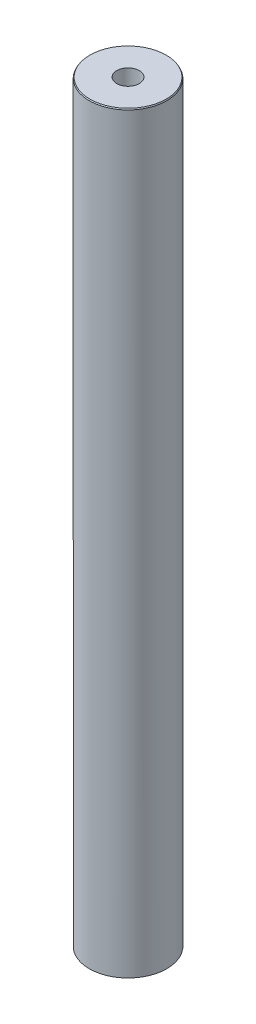
ISO-10303-21;
HEADER;
FILE_DESCRIPTION(('STEP AP214'),'2;1');
FILE_NAME('part.step','',(''),(''),'','','');
FILE_SCHEMA(('AUTOMOTIVE_DESIGN { 1 0 10303 214 1 1 1 1 }'));
ENDSEC;
DATA;
#1=APPLICATION_CONTEXT('core data for automotive mechanical design processes');
#2=APPLICATION_PROTOCOL_DEFINITION('international standard','automotive_design',2000,#1);
#3=PRODUCT_CONTEXT('',#1,'mechanical');
#4=PRODUCT('Part','Part','',(#3));
#5=PRODUCT_RELATED_PRODUCT_CATEGORY('part','',(#4));
#6=PRODUCT_DEFINITION_FORMATION('','',#4);
#7=PRODUCT_DEFINITION_CONTEXT('part definition',#1,'design');
#8=PRODUCT_DEFINITION('design','',#6,#7);
#9=PRODUCT_DEFINITION_SHAPE('','',#8);
#10=(LENGTH_UNIT() NAMED_UNIT(*) SI_UNIT(.MILLI.,.METRE.));
#11=(NAMED_UNIT(*) PLANE_ANGLE_UNIT() SI_UNIT($,.RADIAN.));
#12=(NAMED_UNIT(*) SI_UNIT($,.STERADIAN.) SOLID_ANGLE_UNIT());
#13=UNCERTAINTY_MEASURE_WITH_UNIT(LENGTH_MEASURE(1.E-05),#10,'distance_accuracy_value','');
#14=(GEOMETRIC_REPRESENTATION_CONTEXT(3) GLOBAL_UNCERTAINTY_ASSIGNED_CONTEXT((#13)) GLOBAL_UNIT_ASSIGNED_CONTEXT((#10,
#11,#12)) REPRESENTATION_CONTEXT('',''));
#15=CARTESIAN_POINT('',(0.,0.,0.));
#16=DIRECTION('',(0.,0.,1.));
#17=DIRECTION('',(1.,0.,0.));
#18=AXIS2_PLACEMENT_3D('',#15,#16,#17);
#19=CARTESIAN_POINT('',(0.,145.748430164942,0.));
#20=DIRECTION('',(0.,-1.,0.));
#21=DIRECTION('',(0.,0.,-1.));
#22=AXIS2_PLACEMENT_3D('',#19,#20,#21);
#23=CYLINDRICAL_SURFACE('',#22,7.5);
#24=CARTESIAN_POINT('',(0.,145.539965151386,0.));
#25=DIRECTION('',(0.,1.,0.));
#26=DIRECTION('',(0.,0.,1.));
#27=AXIS2_PLACEMENT_3D('',#24,#25,#26);
#28=CIRCLE('',#27,7.5);
#29=CARTESIAN_POINT('',(0.,145.539965151386,-7.5));
#30=VERTEX_POINT('',#29);
#31=EDGE_CURVE('E50',#30,#30,#28,.F.);
#32=CARTESIAN_POINT('',(0.,0.120357331693299,0.));
#33=DIRECTION('',(0.,1.,0.));
#34=DIRECTION('',(0.,0.,1.));
#35=AXIS2_PLACEMENT_3D('',#32,#33,#34);
#36=CIRCLE('',#35,7.5);
#37=CARTESIAN_POINT('',(0.,0.120357331693299,-7.5));
#38=VERTEX_POINT('',#37);
#39=EDGE_CURVE('E51',#38,#38,#36,.T.);
#40=CARTESIAN_POINT('',(0.,145.539965151386,-7.5));
#41=CARTESIAN_POINT('',(0.,144.025177569931,-7.5));
#42=CARTESIAN_POINT('',(0.,142.510389988476,-7.5));
#43=CARTESIAN_POINT('',(0.,139.480814825566,-7.5));
#44=CARTESIAN_POINT('',(0.,137.96602724411,-7.5));
#45=CARTESIAN_POINT('',(0.,134.9364520812,-7.5));
#46=CARTESIAN_POINT('',(0.,133.421664499745,-7.5));
#47=CARTESIAN_POINT('',(0.,130.392089336835,-7.5));
#48=CARTESIAN_POINT('',(0.,128.87730175538,-7.5));
#49=CARTESIAN_POINT('',(0.,125.847726592469,-7.5));
#50=CARTESIAN_POINT('',(0.,124.332939011014,-7.5));
#51=CARTESIAN_POINT('',(0.,121.303363848104,-7.5));
#52=CARTESIAN_POINT('',(0.,119.788576266649,-7.5));
#53=CARTESIAN_POINT('',(0.,116.759001103739,-7.5));
#54=CARTESIAN_POINT('',(0.,115.244213522283,-7.5));
#55=CARTESIAN_POINT('',(0.,112.214638359373,-7.5));
#56=CARTESIAN_POINT('',(0.,110.699850777918,-7.5));
#57=CARTESIAN_POINT('',(0.,107.670275615008,-7.5));
#58=CARTESIAN_POINT('',(0.,106.155488033553,-7.5));
#59=CARTESIAN_POINT('',(0.,103.125912870642,-7.5));
#60=CARTESIAN_POINT('',(0.,101.611125289187,-7.5));
#61=CARTESIAN_POINT('',(0.,98.581550126277,-7.5));
#62=CARTESIAN_POINT('',(0.,97.0667625448219,-7.5));
#63=CARTESIAN_POINT('',(0.,94.0371873819116,-7.5));
#64=CARTESIAN_POINT('',(0.,92.5223998004565,-7.5));
#65=CARTESIAN_POINT('',(0.,89.4928246375462,-7.5));
#66=CARTESIAN_POINT('',(0.,87.9780370560911,-7.5));
#67=CARTESIAN_POINT('',(0.,84.9484618931808,-7.5));
#68=CARTESIAN_POINT('',(0.,83.4336743117257,-7.5));
#69=CARTESIAN_POINT('',(0.,80.4040991488154,-7.5));
#70=CARTESIAN_POINT('',(0.,78.8893115673603,-7.5));
#71=CARTESIAN_POINT('',(0.,75.85973640445,-7.5));
#72=CARTESIAN_POINT('',(0.,74.3449488229949,-7.5));
#73=CARTESIAN_POINT('',(0.,71.3153736600846,-7.5));
#74=CARTESIAN_POINT('',(0.,69.8005860786295,-7.5));
#75=CARTESIAN_POINT('',(0.,66.7710109157192,-7.5));
#76=CARTESIAN_POINT('',(0.,65.2562233342641,-7.5));
#77=CARTESIAN_POINT('',(0.,62.2266481713538,-7.5));
#78=CARTESIAN_POINT('',(0.,60.7118605898987,-7.5));
#79=CARTESIAN_POINT('',(0.,57.6822854269884,-7.5));
#80=CARTESIAN_POINT('',(0.,56.1674978455333,-7.5));
#81=CARTESIAN_POINT('',(0.,53.137922682623,-7.5));
#82=CARTESIAN_POINT('',(0.,51.6231351011679,-7.5));
#83=CARTESIAN_POINT('',(0.,48.5935599382576,-7.5));
#84=CARTESIAN_POINT('',(0.,47.0787723568025,-7.5));
#85=CARTESIAN_POINT('',(0.,44.0491971938922,-7.5));
#86=CARTESIAN_POINT('',(0.,42.534409612437,-7.5));
#87=CARTESIAN_POINT('',(0.,39.5048344495268,-7.5));
#88=CARTESIAN_POINT('',(0.,37.9900468680717,-7.5));
#89=CARTESIAN_POINT('',(0.,34.9604717051614,-7.5));
#90=CARTESIAN_POINT('',(0.,33.4456841237063,-7.5));
#91=CARTESIAN_POINT('',(0.,30.416108960796,-7.5));
#92=CARTESIAN_POINT('',(0.,28.9013213793409,-7.5));
#93=CARTESIAN_POINT('',(0.,25.8717462164306,-7.5));
#94=CARTESIAN_POINT('',(0.,24.3569586349754,-7.5));
#95=CARTESIAN_POINT('',(0.,21.3273834720652,-7.5));
#96=CARTESIAN_POINT('',(0.,19.81259589061,-7.5));
#97=CARTESIAN_POINT('',(0.,16.7830207276998,-7.5));
#98=CARTESIAN_POINT('',(0.,15.2682331462446,-7.5));
#99=CARTESIAN_POINT('',(0.,12.2386579833344,-7.5));
#100=CARTESIAN_POINT('',(0.,10.7238704018792,-7.5));
#101=CARTESIAN_POINT('',(0.,7.69429523896896,-7.5));
#102=CARTESIAN_POINT('',(0.,6.17950765751383,-7.5));
#103=CARTESIAN_POINT('',(0.,3.14993249460356,-7.5));
#104=CARTESIAN_POINT('',(0.,1.63514491314843,-7.5));
#105=CARTESIAN_POINT('',(0.,0.120357331693299,-7.5));
#106=B_SPLINE_CURVE_WITH_KNOTS('',3,(#40,#41,#42,#43,#44,#45,#46,#47,#48,#49,#50,#51,#52,#53,
#54,#55,#56,#57,#58,#59,#60,#61,#62,#63,#64,#65,#66,#67,#68,#69,#70,#71,#72,#73,#74,#75,#76,#77,
#78,#79,#80,#81,#82,#83,#84,#85,#86,#87,#88,#89,#90,#91,#92,#93,#94,#95,#96,#97,#98,#99,#100,
#101,#102,#103,#104,#105),.UNSPECIFIED.,.F.,.F.,(4,2,2,2,2,2,2,2,2,2,2,2,2,2,2,2,2,2,2,2,2,2,2,
2,2,2,2,2,2,2,2,2,4),(0.,4.5443627443654,9.0887254887308,13.6330882330962,18.1774509774616,
22.721813721827,27.2661764661924,31.8105392105578,36.3549019549232,40.8992646992886,
45.443627443654,49.9879901880194,54.5323529323848,59.0767156767502,63.6210784211156,
68.165441165481,72.7098039098464,77.2541666542118,81.7985293985772,86.3428921429426,
90.887254887308,95.4316176316734,99.9759803760388,104.520343120404,109.06470586477,
113.609068609135,118.1534313535,122.697794097866,127.242156842231,131.786519586597,
136.330882330962,140.875245075327,145.419607819693),.UNSPECIFIED.);
#107=EDGE_CURVE('BSEAM39',#30,#38,#106,.T.);
#108=ORIENTED_EDGE('',*,*,#31,.T.);
#109=ORIENTED_EDGE('',*,*,#39,.T.);
#110=ORIENTED_EDGE('',*,*,#107,.T.);
#111=ORIENTED_EDGE('',*,*,#107,.F.);
#112=EDGE_LOOP('',(#108,#110,#109,#111));
#113=FACE_BOUND('',#112,.T.);
#114=ADVANCED_FACE('F39',(#113),#23,.T.);
#115=CARTESIAN_POINT('',(0.,145.748430164942,0.));
#116=DIRECTION('',(0.,1.,0.));
#117=DIRECTION('',(0.,0.,1.));
#118=AXIS2_PLACEMENT_3D('',#115,#116,#117);
#119=PLANE('',#118);
#120=CARTESIAN_POINT('',(0.,145.748430164942,0.));
#121=DIRECTION('',(0.,1.,0.));
#122=DIRECTION('',(0.,0.,1.));
#123=AXIS2_PLACEMENT_3D('',#120,#121,#122);
#124=CIRCLE('',#123,7.37964266830687);
#125=CARTESIAN_POINT('',(0.,145.748430164942,7.37964266830687));
#126=VERTEX_POINT('',#125);
#127=EDGE_CURVE('E54',#126,#126,#124,.T.);
#128=ORIENTED_EDGE('',*,*,#127,.T.);
#129=EDGE_LOOP('',(#128));
#130=FACE_BOUND('',#129,.T.);
#131=CARTESIAN_POINT('',(0.,145.748430164942,0.));
#132=DIRECTION('',(0.,1.,0.));
#133=DIRECTION('',(0.,0.,1.));
#134=AXIS2_PLACEMENT_3D('',#131,#132,#133);
#135=CIRCLE('',#134,2.18043543013962);
#136=CARTESIAN_POINT('',(0.,145.748430164942,-2.18043543013962));
#137=VERTEX_POINT('',#136);
#138=EDGE_CURVE('E58',#137,#137,#135,.T.);
#139=ORIENTED_EDGE('',*,*,#138,.F.);
#140=EDGE_LOOP('',(#139));
#141=FACE_BOUND('',#140,.T.);
#142=ADVANCED_FACE('F69',(#130,#141),#119,.T.);
#143=CARTESIAN_POINT('',(0.,0.,0.));
#144=DIRECTION('',(0.,1.,0.));
#145=DIRECTION('',(0.,0.,1.));
#146=AXIS2_PLACEMENT_3D('',#143,#144,#145);
#147=PLANE('',#146);
#148=CARTESIAN_POINT('',(0.,0.,0.));
#149=DIRECTION('',(0.,1.,0.));
#150=DIRECTION('',(0.,0.,1.));
#151=AXIS2_PLACEMENT_3D('',#148,#149,#150);
#152=CIRCLE('',#151,7.29153498644382);
#153=CARTESIAN_POINT('',(0.,0.,7.29153498644382));
#154=VERTEX_POINT('',#153);
#155=EDGE_CURVE('E10',#154,#154,#152,.F.);
#156=ORIENTED_EDGE('',*,*,#155,.T.);
#157=EDGE_LOOP('',(#156));
#158=FACE_BOUND('',#157,.T.);
#159=CARTESIAN_POINT('',(0.,0.,0.));
#160=DIRECTION('',(0.,1.,0.));
#161=DIRECTION('',(0.,0.,1.));
#162=AXIS2_PLACEMENT_3D('',#159,#160,#161);
#163=CIRCLE('',#162,2.18043543013962);
#164=CARTESIAN_POINT('',(0.,0.,-2.18043543013962));
#165=VERTEX_POINT('',#164);
#166=EDGE_CURVE('E63',#165,#165,#163,.T.);
#167=ORIENTED_EDGE('',*,*,#166,.T.);
#168=EDGE_LOOP('',(#167));
#169=FACE_BOUND('',#168,.T.);
#170=ADVANCED_FACE('F75',(#158,#169),#147,.F.);
#171=CARTESIAN_POINT('',(0.,145.748430164942,0.));
#172=DIRECTION('',(0.,-1.,0.));
#173=DIRECTION('',(0.,0.,-1.));
#174=AXIS2_PLACEMENT_3D('',#171,#172,#173);
#175=CYLINDRICAL_SURFACE('',#174,2.18043543013962);
#176=CARTESIAN_POINT('',(0.,145.748430164942,-2.18043543013962));
#177=CARTESIAN_POINT('',(0.,144.230217350724,-2.18043543013962));
#178=CARTESIAN_POINT('',(0.,142.712004536506,-2.18043543013962));
#179=CARTESIAN_POINT('',(0.,139.675578908069,-2.18043543013962));
#180=CARTESIAN_POINT('',(0.,138.157366093851,-2.18043543013962));
#181=CARTESIAN_POINT('',(0.,135.120940465415,-2.18043543013962));
#182=CARTESIAN_POINT('',(0.,133.602727651197,-2.18043543013962));
#183=CARTESIAN_POINT('',(0.,130.566302022761,-2.18043543013962));
#184=CARTESIAN_POINT('',(0.,129.048089208542,-2.18043543013962));
#185=CARTESIAN_POINT('',(0.,126.011663580106,-2.18043543013962));
#186=CARTESIAN_POINT('',(0.,124.493450765888,-2.18043543013962));
#187=CARTESIAN_POINT('',(0.,121.457025137452,-2.18043543013962));
#188=CARTESIAN_POINT('',(0.,119.938812323234,-2.18043543013962));
#189=CARTESIAN_POINT('',(0.,116.902386694797,-2.18043543013962));
#190=CARTESIAN_POINT('',(0.,115.384173880579,-2.18043543013962));
#191=CARTESIAN_POINT('',(0.,112.347748252143,-2.18043543013962));
#192=CARTESIAN_POINT('',(0.,110.829535437925,-2.18043543013962));
#193=CARTESIAN_POINT('',(0.,107.793109809488,-2.18043543013962));
#194=CARTESIAN_POINT('',(0.,106.27489699527,-2.18043543013962));
#195=CARTESIAN_POINT('',(0.,103.238471366834,-2.18043543013962));
#196=CARTESIAN_POINT('',(0.,101.720258552616,-2.18043543013962));
#197=CARTESIAN_POINT('',(0.,98.6838329241795,-2.18043543013962));
#198=CARTESIAN_POINT('',(0.,97.1656201099614,-2.18043543013962));
#199=CARTESIAN_POINT('',(0.,94.1291944815251,-2.18043543013962));
#200=CARTESIAN_POINT('',(0.,92.6109816673069,-2.18043543013962));
#201=CARTESIAN_POINT('',(0.,89.5745560388706,-2.18043543013962));
#202=CARTESIAN_POINT('',(0.,88.0563432246525,-2.18043543013962));
#203=CARTESIAN_POINT('',(0.,85.0199175962162,-2.18043543013962));
#204=CARTESIAN_POINT('',(0.,83.501704781998,-2.18043543013962));
#205=CARTESIAN_POINT('',(0.,80.4652791535618,-2.18043543013962));
#206=CARTESIAN_POINT('',(0.,78.9470663393436,-2.18043543013962));
#207=CARTESIAN_POINT('',(0.,75.9106407109073,-2.18043543013962));
#208=CARTESIAN_POINT('',(0.,74.3924278966892,-2.18043543013962));
#209=CARTESIAN_POINT('',(0.,71.3560022682529,-2.18043543013962));
#210=CARTESIAN_POINT('',(0.,69.8377894540347,-2.18043543013962));
#211=CARTESIAN_POINT('',(0.,66.8013638255984,-2.18043543013962));
#212=CARTESIAN_POINT('',(0.,65.2831510113803,-2.18043543013962));
#213=CARTESIAN_POINT('',(0.,62.246725382944,-2.18043543013962));
#214=CARTESIAN_POINT('',(0.,60.7285125687258,-2.18043543013962));
#215=CARTESIAN_POINT('',(0.,57.6920869402895,-2.18043543013962));
#216=CARTESIAN_POINT('',(0.,56.1738741260714,-2.18043543013962));
#217=CARTESIAN_POINT('',(0.,53.1374484976351,-2.18043543013962));
#218=CARTESIAN_POINT('',(0.,51.619235683417,-2.18043543013962));
#219=CARTESIAN_POINT('',(0.,48.5828100549807,-2.18043543013962));
#220=CARTESIAN_POINT('',(0.,47.0645972407625,-2.18043543013962));
#221=CARTESIAN_POINT('',(0.,44.0281716123262,-2.18043543013962));
#222=CARTESIAN_POINT('',(0.,42.5099587981081,-2.18043543013962));
#223=CARTESIAN_POINT('',(0.,39.4735331696718,-2.18043543013962));
#224=CARTESIAN_POINT('',(0.,37.9553203554536,-2.18043543013962));
#225=CARTESIAN_POINT('',(0.,34.9188947270173,-2.18043543013962));
#226=CARTESIAN_POINT('',(0.,33.4006819127992,-2.18043543013962));
#227=CARTESIAN_POINT('',(0.,30.3642562843629,-2.18043543013962));
#228=CARTESIAN_POINT('',(0.,28.8460434701448,-2.18043543013962));
#229=CARTESIAN_POINT('',(0.,25.8096178417085,-2.18043543013962));
#230=CARTESIAN_POINT('',(0.,24.2914050274903,-2.18043543013962));
#231=CARTESIAN_POINT('',(0.,21.254979399054,-2.18043543013962));
#232=CARTESIAN_POINT('',(0.,19.7367665848359,-2.18043543013962));
#233=CARTESIAN_POINT('',(0.,16.7003409563996,-2.18043543013962));
#234=CARTESIAN_POINT('',(0.,15.1821281421815,-2.18043543013962));
#235=CARTESIAN_POINT('',(0.,12.1457025137452,-2.18043543013962));
#236=CARTESIAN_POINT('',(0.,10.627489699527,-2.18043543013962));
#237=CARTESIAN_POINT('',(0.,7.59106407109073,-2.18043543013962));
#238=CARTESIAN_POINT('',(0.,6.07285125687259,-2.18043543013962));
#239=CARTESIAN_POINT('',(0.,3.03642562843629,-2.18043543013962));
#240=CARTESIAN_POINT('',(0.,1.51821281421814,-2.18043543013962));
#241=CARTESIAN_POINT('',(0.,0.,-2.18043543013962));
#242=B_SPLINE_CURVE_WITH_KNOTS('',3,(#176,#177,#178,#179,#180,#181,#182,#183,#184,#185,#186,
#187,#188,#189,#190,#191,#192,#193,#194,#195,#196,#197,#198,#199,#200,#201,#202,#203,#204,#205,
#206,#207,#208,#209,#210,#211,#212,#213,#214,#215,#216,#217,#218,#219,#220,#221,#222,#223,#224,
#225,#226,#227,#228,#229,#230,#231,#232,#233,#234,#235,#236,#237,#238,#239,#240,#241),
.UNSPECIFIED.,.F.,.F.,(4,2,2,2,2,2,2,2,2,2,2,2,2,2,2,2,2,2,2,2,2,2,2,2,2,2,2,2,2,2,2,2,4),(0.,
4.55463844265444,9.10927688530888,13.6639153279633,18.2185537706178,22.7731922132722,
27.3278306559267,31.8824690985811,36.4371075412355,40.99174598389,45.5463844265444,
50.1010228691989,54.6556613118533,59.2102997545077,63.7649381971622,68.3195766398166,
72.8742150824711,77.4288535251255,81.9834919677799,86.5381304104344,91.0927688530888,
95.6474072957432,100.202045738398,104.756684181052,109.311322623707,113.865961066361,
118.420599509015,122.97523795167,127.529876394324,132.084514836979,136.639153279633,
141.193791722288,145.748430164942),.UNSPECIFIED.);
#243=EDGE_CURVE('BSEAM70',#137,#165,#242,.T.);
#244=ORIENTED_EDGE('',*,*,#138,.T.);
#245=ORIENTED_EDGE('',*,*,#166,.F.);
#246=ORIENTED_EDGE('',*,*,#243,.T.);
#247=ORIENTED_EDGE('',*,*,#243,.F.);
#248=EDGE_LOOP('',(#244,#246,#245,#247));
#249=FACE_BOUND('',#248,.T.);
#250=ADVANCED_FACE('F70',(#249),#175,.F.);
#251=CARTESIAN_POINT('',(0.,145.748430164942,0.));
#252=DIRECTION('',(0.,-1.,0.));
#253=DIRECTION('',(0.,0.,-1.));
#254=AXIS2_PLACEMENT_3D('',#251,#252,#253);
#255=CONICAL_SURFACE('',#254,7.37964266830687,0.523598775598336);
#256=ORIENTED_EDGE('',*,*,#31,.F.);
#257=EDGE_LOOP('',(#256));
#258=FACE_BOUND('',#257,.T.);
#259=ORIENTED_EDGE('',*,*,#127,.F.);
#260=EDGE_LOOP('',(#259));
#261=FACE_BOUND('',#260,.T.);
#262=ADVANCED_FACE('F81',(#258,#261),#255,.T.);
#263=CARTESIAN_POINT('',(0.,0.120357331693272,0.));
#264=DIRECTION('',(0.,1.,0.));
#265=DIRECTION('',(0.,0.,1.));
#266=AXIS2_PLACEMENT_3D('',#263,#264,#265);
#267=CONICAL_SURFACE('',#266,7.5,1.04719755119663);
#268=ORIENTED_EDGE('',*,*,#155,.F.);
#269=EDGE_LOOP('',(#268));
#270=FACE_BOUND('',#269,.T.);
#271=ORIENTED_EDGE('',*,*,#39,.F.);
#272=EDGE_LOOP('',(#271));
#273=FACE_BOUND('',#272,.T.);
#274=ADVANCED_FACE('F45',(#270,#273),#267,.T.);
#275=CLOSED_SHELL('',(#114,#142,#170,#250,#262,#274));
#276=MANIFOLD_SOLID_BREP('B2',#275);
#277=ADVANCED_BREP_SHAPE_REPRESENTATION('',(#18,#276),#14);
#278=SHAPE_DEFINITION_REPRESENTATION(#9,#277);
ENDSEC;
END-ISO-10303-21;
